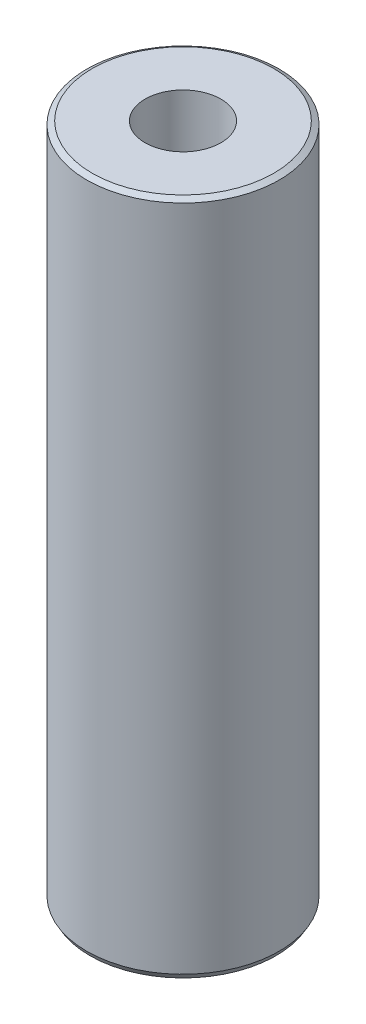
ISO-10303-21;
HEADER;
FILE_DESCRIPTION(('STEP AP214'),'2;1');
FILE_NAME('part.step','',(''),(''),'','','');
FILE_SCHEMA(('AUTOMOTIVE_DESIGN { 1 0 10303 214 1 1 1 1 }'));
ENDSEC;
DATA;
#1=APPLICATION_CONTEXT('core data for automotive mechanical design processes');
#2=APPLICATION_PROTOCOL_DEFINITION('international standard','automotive_design',2000,#1);
#3=PRODUCT_CONTEXT('',#1,'mechanical');
#4=PRODUCT('Part','Part','',(#3));
#5=PRODUCT_RELATED_PRODUCT_CATEGORY('part','',(#4));
#6=PRODUCT_DEFINITION_FORMATION('','',#4);
#7=PRODUCT_DEFINITION_CONTEXT('part definition',#1,'design');
#8=PRODUCT_DEFINITION('design','',#6,#7);
#9=PRODUCT_DEFINITION_SHAPE('','',#8);
#10=(LENGTH_UNIT() NAMED_UNIT(*) SI_UNIT(.MILLI.,.METRE.));
#11=(NAMED_UNIT(*) PLANE_ANGLE_UNIT() SI_UNIT($,.RADIAN.));
#12=(NAMED_UNIT(*) SI_UNIT($,.STERADIAN.) SOLID_ANGLE_UNIT());
#13=UNCERTAINTY_MEASURE_WITH_UNIT(LENGTH_MEASURE(1.E-05),#10,'distance_accuracy_value','');
#14=(GEOMETRIC_REPRESENTATION_CONTEXT(3) GLOBAL_UNCERTAINTY_ASSIGNED_CONTEXT((#13)) GLOBAL_UNIT_ASSIGNED_CONTEXT((#10,
#11,#12)) REPRESENTATION_CONTEXT('',''));
#15=CARTESIAN_POINT('',(0.,0.,0.));
#16=DIRECTION('',(0.,0.,1.));
#17=DIRECTION('',(1.,0.,0.));
#18=AXIS2_PLACEMENT_3D('',#15,#16,#17);
#19=CARTESIAN_POINT('',(0.,263.669780206794,0.));
#20=DIRECTION('',(0.,-1.,0.));
#21=DIRECTION('',(0.,0.,-1.));
#22=AXIS2_PLACEMENT_3D('',#19,#20,#21);
#23=CYLINDRICAL_SURFACE('',#22,37.5);
#24=CARTESIAN_POINT('',(0.,262.445238600446,0.));
#25=DIRECTION('',(0.,1.,0.));
#26=DIRECTION('',(0.,0.,1.));
#27=AXIS2_PLACEMENT_3D('',#24,#25,#26);
#28=CIRCLE('',#27,37.5);
#29=CARTESIAN_POINT('',(0.,262.445238600446,37.5));
#30=VERTEX_POINT('',#29);
#31=EDGE_CURVE('E50',#30,#30,#28,.F.);
#32=ORIENTED_EDGE('',*,*,#31,.T.);
#33=EDGE_LOOP('',(#32));
#34=FACE_BOUND('',#33,.T.);
#35=CARTESIAN_POINT('',(0.,2.12096827817659,0.));
#36=DIRECTION('',(0.,1.,0.));
#37=DIRECTION('',(0.,0.,1.));
#38=AXIS2_PLACEMENT_3D('',#35,#36,#37);
#39=CIRCLE('',#38,37.5);
#40=CARTESIAN_POINT('',(0.,2.12096827817659,37.5));
#41=VERTEX_POINT('',#40);
#42=EDGE_CURVE('E51',#41,#41,#39,.T.);
#43=ORIENTED_EDGE('',*,*,#42,.T.);
#44=EDGE_LOOP('',(#43));
#45=FACE_BOUND('',#44,.T.);
#46=ADVANCED_FACE('F39',(#34,#45),#23,.T.);
#47=CARTESIAN_POINT('',(0.,263.669780206794,0.));
#48=DIRECTION('',(0.,1.,0.));
#49=DIRECTION('',(0.,0.,1.));
#50=AXIS2_PLACEMENT_3D('',#47,#48,#49);
#51=PLANE('',#50);
#52=CARTESIAN_POINT('',(0.,263.669780206794,0.));
#53=DIRECTION('',(0.,1.,0.));
#54=DIRECTION('',(0.,0.,1.));
#55=AXIS2_PLACEMENT_3D('',#52,#53,#54);
#56=CIRCLE('',#55,35.3790317218235);
#57=CARTESIAN_POINT('',(0.,263.669780206794,35.3790317218235));
#58=VERTEX_POINT('',#57);
#59=EDGE_CURVE('E54',#58,#58,#56,.T.);
#60=ORIENTED_EDGE('',*,*,#59,.T.);
#61=EDGE_LOOP('',(#60));
#62=FACE_BOUND('',#61,.T.);
#63=CARTESIAN_POINT('',(0.,263.669780206794,0.));
#64=DIRECTION('',(0.,1.,0.));
#65=DIRECTION('',(0.,0.,1.));
#66=AXIS2_PLACEMENT_3D('',#63,#64,#65);
#67=CIRCLE('',#66,14.7807436441058);
#68=CARTESIAN_POINT('',(0.,263.669780206794,14.7807436441058));
#69=VERTEX_POINT('',#68);
#70=EDGE_CURVE('E58',#69,#69,#67,.T.);
#71=ORIENTED_EDGE('',*,*,#70,.F.);
#72=EDGE_LOOP('',(#71));
#73=FACE_BOUND('',#72,.T.);
#74=ADVANCED_FACE('F69',(#62,#73),#51,.T.);
#75=CARTESIAN_POINT('',(0.,0.,0.));
#76=DIRECTION('',(0.,1.,0.));
#77=DIRECTION('',(0.,0.,1.));
#78=AXIS2_PLACEMENT_3D('',#75,#76,#77);
#79=PLANE('',#78);
#80=CARTESIAN_POINT('',(0.,0.,0.));
#81=DIRECTION('',(0.,1.,0.));
#82=DIRECTION('',(0.,0.,1.));
#83=AXIS2_PLACEMENT_3D('',#80,#81,#82);
#84=CIRCLE('',#83,36.2754583936521);
#85=CARTESIAN_POINT('',(0.,0.,36.2754583936521));
#86=VERTEX_POINT('',#85);
#87=EDGE_CURVE('E10',#86,#86,#84,.F.);
#88=ORIENTED_EDGE('',*,*,#87,.T.);
#89=EDGE_LOOP('',(#88));
#90=FACE_BOUND('',#89,.T.);
#91=CARTESIAN_POINT('',(0.,0.,0.));
#92=DIRECTION('',(0.,1.,0.));
#93=DIRECTION('',(0.,0.,1.));
#94=AXIS2_PLACEMENT_3D('',#91,#92,#93);
#95=CIRCLE('',#94,14.7807436441058);
#96=CARTESIAN_POINT('',(0.,0.,14.7807436441058));
#97=VERTEX_POINT('',#96);
#98=EDGE_CURVE('E63',#97,#97,#95,.T.);
#99=ORIENTED_EDGE('',*,*,#98,.T.);
#100=EDGE_LOOP('',(#99));
#101=FACE_BOUND('',#100,.T.);
#102=ADVANCED_FACE('F75',(#90,#101),#79,.F.);
#103=CARTESIAN_POINT('',(0.,263.669780206794,0.));
#104=DIRECTION('',(0.,-1.,0.));
#105=DIRECTION('',(0.,0.,-1.));
#106=AXIS2_PLACEMENT_3D('',#103,#104,#105);
#107=CYLINDRICAL_SURFACE('',#106,14.7807436441058);
#108=ORIENTED_EDGE('',*,*,#70,.T.);
#109=EDGE_LOOP('',(#108));
#110=FACE_BOUND('',#109,.T.);
#111=ORIENTED_EDGE('',*,*,#98,.F.);
#112=EDGE_LOOP('',(#111));
#113=FACE_BOUND('',#112,.T.);
#114=ADVANCED_FACE('F70',(#110,#113),#107,.F.);
#115=CARTESIAN_POINT('',(0.,263.669780206794,0.));
#116=DIRECTION('',(0.,-1.,0.));
#117=DIRECTION('',(0.,0.,-1.));
#118=AXIS2_PLACEMENT_3D('',#115,#116,#117);
#119=CONICAL_SURFACE('',#118,35.3790317218235,1.0471975511966);
#120=ORIENTED_EDGE('',*,*,#31,.F.);
#121=EDGE_LOOP('',(#120));
#122=FACE_BOUND('',#121,.T.);
#123=ORIENTED_EDGE('',*,*,#59,.F.);
#124=EDGE_LOOP('',(#123));
#125=FACE_BOUND('',#124,.T.);
#126=ADVANCED_FACE('F81',(#122,#125),#119,.T.);
#127=CARTESIAN_POINT('',(0.,2.12096827817659,0.));
#128=DIRECTION('',(0.,1.,0.));
#129=DIRECTION('',(0.,0.,1.));
#130=AXIS2_PLACEMENT_3D('',#127,#128,#129);
#131=CONICAL_SURFACE('',#130,37.5,0.523598775598298);
#132=ORIENTED_EDGE('',*,*,#87,.F.);
#133=EDGE_LOOP('',(#132));
#134=FACE_BOUND('',#133,.T.);
#135=ORIENTED_EDGE('',*,*,#42,.F.);
#136=EDGE_LOOP('',(#135));
#137=FACE_BOUND('',#136,.T.);
#138=ADVANCED_FACE('F45',(#134,#137),#131,.T.);
#139=CLOSED_SHELL('',(#46,#74,#102,#114,#126,#138));
#140=MANIFOLD_SOLID_BREP('B2',#139);
#141=ADVANCED_BREP_SHAPE_REPRESENTATION('',(#18,#140),#14);
#142=SHAPE_DEFINITION_REPRESENTATION(#9,#141);
ENDSEC;
END-ISO-10303-21;
